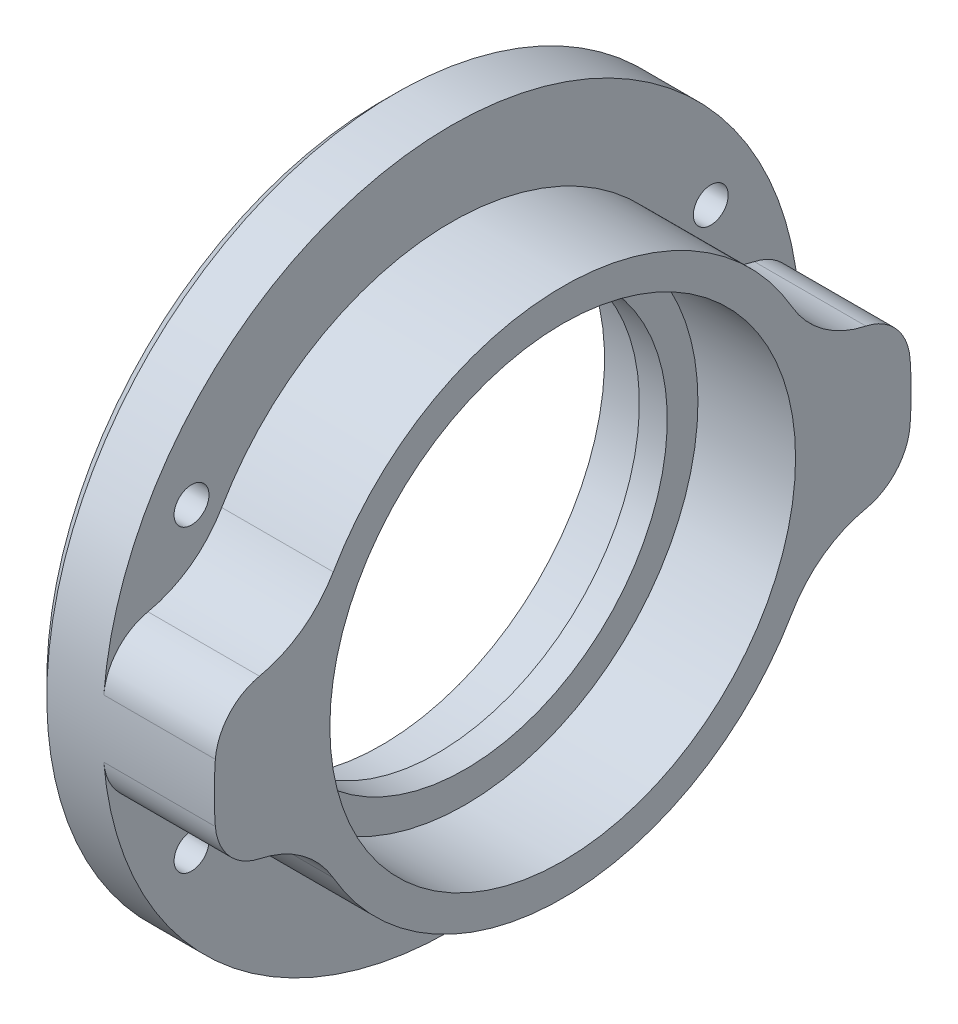
ISO-10303-21;
HEADER;
FILE_DESCRIPTION(('STEP AP214'),'2;1');
FILE_NAME('part.step','',(''),(''),'','','');
FILE_SCHEMA(('AUTOMOTIVE_DESIGN { 1 0 10303 214 1 1 1 1 }'));
ENDSEC;
DATA;
#1=APPLICATION_CONTEXT('core data for automotive mechanical design processes');
#2=APPLICATION_PROTOCOL_DEFINITION('international standard','automotive_design',2000,#1);
#3=PRODUCT_CONTEXT('',#1,'mechanical');
#4=PRODUCT('Part','Part','',(#3));
#5=PRODUCT_RELATED_PRODUCT_CATEGORY('part','',(#4));
#6=PRODUCT_DEFINITION_FORMATION('','',#4);
#7=PRODUCT_DEFINITION_CONTEXT('part definition',#1,'design');
#8=PRODUCT_DEFINITION('design','',#6,#7);
#9=PRODUCT_DEFINITION_SHAPE('','',#8);
#10=(LENGTH_UNIT() NAMED_UNIT(*) SI_UNIT(.MILLI.,.METRE.));
#11=(NAMED_UNIT(*) PLANE_ANGLE_UNIT() SI_UNIT($,.RADIAN.));
#12=(NAMED_UNIT(*) SI_UNIT($,.STERADIAN.) SOLID_ANGLE_UNIT());
#13=UNCERTAINTY_MEASURE_WITH_UNIT(LENGTH_MEASURE(1.E-05),#10,'distance_accuracy_value','');
#14=(GEOMETRIC_REPRESENTATION_CONTEXT(3) GLOBAL_UNCERTAINTY_ASSIGNED_CONTEXT((#13)) GLOBAL_UNIT_ASSIGNED_CONTEXT((#10,
#11,#12)) REPRESENTATION_CONTEXT('',''));
#15=CARTESIAN_POINT('',(0.,0.,0.));
#16=DIRECTION('',(0.,0.,1.));
#17=DIRECTION('',(1.,0.,0.));
#18=AXIS2_PLACEMENT_3D('',#15,#16,#17);
#19=CARTESIAN_POINT('',(-18.5380469099545,0.,0.));
#20=DIRECTION('',(-1.,0.,0.));
#21=DIRECTION('',(0.,0.,1.));
#22=AXIS2_PLACEMENT_3D('',#19,#20,#21);
#23=CYLINDRICAL_SURFACE('',#22,19.);
#24=DIRECTION('',(-1.,0.,0.));
#25=VECTOR('',#24,1.);
#26=CARTESIAN_POINT('',(3.,-9.50000000000003,-16.4544826719043));
#27=LINE('',#26,#25);
#28=CARTESIAN_POINT('',(3.,-9.50000000000003,-16.4544826719043));
#29=VERTEX_POINT('',#28);
#30=CARTESIAN_POINT('',(-5.,-9.50000000000003,-16.4544826719043));
#31=VERTEX_POINT('',#30);
#32=EDGE_CURVE('E157',#29,#31,#27,.T.);
#33=ORIENTED_EDGE('',*,*,#32,.F.);
#34=CARTESIAN_POINT('',(3.,0.,0.));
#35=DIRECTION('',(-1.,0.,0.));
#36=DIRECTION('',(0.,0.,1.));
#37=AXIS2_PLACEMENT_3D('',#34,#35,#36);
#38=CIRCLE('',#37,19.);
#39=CARTESIAN_POINT('',(3.,-9.50000000000002,16.4544826719043));
#40=VERTEX_POINT('',#39);
#41=EDGE_CURVE('E138',#29,#40,#38,.T.);
#42=ORIENTED_EDGE('',*,*,#41,.T.);
#43=DIRECTION('',(-1.,0.,0.));
#44=VECTOR('',#43,1.);
#45=CARTESIAN_POINT('',(3.,-9.50000000000002,16.4544826719043));
#46=LINE('',#45,#44);
#47=CARTESIAN_POINT('',(-5.,-9.50000000000002,16.4544826719043));
#48=VERTEX_POINT('',#47);
#49=EDGE_CURVE('E223',#40,#48,#46,.T.);
#50=ORIENTED_EDGE('',*,*,#49,.T.);
#51=CARTESIAN_POINT('',(-5.,0.,0.));
#52=DIRECTION('',(-1.,0.,0.));
#53=DIRECTION('',(0.,0.,1.));
#54=AXIS2_PLACEMENT_3D('',#51,#52,#53);
#55=CIRCLE('',#54,19.);
#56=EDGE_CURVE('E158',#31,#48,#55,.T.);
#57=ORIENTED_EDGE('',*,*,#56,.F.);
#58=EDGE_LOOP('',(#33,#42,#50,#57));
#59=FACE_BOUND('',#58,.T.);
#60=ADVANCED_FACE('F47',(#59),#23,.T.);
#61=CARTESIAN_POINT('',(-5.,19.,0.));
#62=DIRECTION('',(-1.,0.,0.));
#63=DIRECTION('',(0.,0.,1.));
#64=AXIS2_PLACEMENT_3D('',#61,#62,#63);
#65=PLANE('',#64);
#66=CARTESIAN_POINT('',(-5.,-10.75,18.6195461813654));
#67=DIRECTION('',(-1.,0.,0.));
#68=DIRECTION('',(0.,0.,1.));
#69=AXIS2_PLACEMENT_3D('',#66,#67,#68);
#70=CIRCLE('',#69,1.25);
#71=CARTESIAN_POINT('',(-5.,-10.75,19.8695461813654));
#72=VERTEX_POINT('',#71);
#73=EDGE_CURVE('E342',#72,#72,#70,.T.);
#74=ORIENTED_EDGE('',*,*,#73,.T.);
#75=EDGE_LOOP('',(#74));
#76=FACE_BOUND('',#75,.T.);
#77=CARTESIAN_POINT('',(-5.,-10.75,-18.6195461813654));
#78=DIRECTION('',(-1.,0.,0.));
#79=DIRECTION('',(0.,0.,1.));
#80=AXIS2_PLACEMENT_3D('',#77,#78,#79);
#81=CIRCLE('',#80,1.25);
#82=CARTESIAN_POINT('',(-5.,-10.75,-17.3695461813654));
#83=VERTEX_POINT('',#82);
#84=EDGE_CURVE('E336',#83,#83,#81,.T.);
#85=ORIENTED_EDGE('',*,*,#84,.T.);
#86=EDGE_LOOP('',(#85));
#87=FACE_BOUND('',#86,.T.);
#88=CARTESIAN_POINT('',(-5.,-1.7540333075852,-20.9266186269039));
#89=DIRECTION('',(-1.,0.,0.));
#90=DIRECTION('',(0.,0.,1.));
#91=AXIS2_PLACEMENT_3D('',#88,#89,#90);
#92=CIRCLE('',#91,4.);
#93=CARTESIAN_POINT('',(-5.,-2.08813488998238,-24.9126412225047));
#94=VERTEX_POINT('',#93);
#95=CARTESIAN_POINT('',(-5.,-5.66935553839015,-21.7453077186626));
#96=VERTEX_POINT('',#95);
#97=EDGE_CURVE('E63',#94,#96,#92,.T.);
#98=ORIENTED_EDGE('',*,*,#97,.T.);
#99=CARTESIAN_POINT('',(-5.,-13.5,-23.3826859021798));
#100=DIRECTION('',(-1.,0.,0.));
#101=DIRECTION('',(0.,0.,1.));
#102=AXIS2_PLACEMENT_3D('',#99,#100,#101);
#103=CIRCLE('',#102,8.);
#104=EDGE_CURVE('E182',#96,#31,#103,.F.);
#105=ORIENTED_EDGE('',*,*,#104,.T.);
#106=ORIENTED_EDGE('',*,*,#56,.T.);
#107=CARTESIAN_POINT('',(-5.,-13.5,23.3826859021798));
#108=DIRECTION('',(-1.,0.,0.));
#109=DIRECTION('',(0.,0.,1.));
#110=AXIS2_PLACEMENT_3D('',#107,#108,#109);
#111=CIRCLE('',#110,8.);
#112=CARTESIAN_POINT('',(-5.,-5.66935553839014,21.7453077186626));
#113=VERTEX_POINT('',#112);
#114=EDGE_CURVE('E193',#48,#113,#111,.F.);
#115=ORIENTED_EDGE('',*,*,#114,.T.);
#116=CARTESIAN_POINT('',(-5.,-1.7540333075852,20.9266186269039));
#117=DIRECTION('',(-1.,0.,0.));
#118=DIRECTION('',(0.,0.,1.));
#119=AXIS2_PLACEMENT_3D('',#116,#117,#118);
#120=CIRCLE('',#119,4.);
#121=CARTESIAN_POINT('',(-5.,-2.08813488998238,24.9126412225047));
#122=VERTEX_POINT('',#121);
#123=EDGE_CURVE('E189',#113,#122,#120,.T.);
#124=ORIENTED_EDGE('',*,*,#123,.T.);
#125=CARTESIAN_POINT('',(-5.,0.,0.));
#126=DIRECTION('',(-1.,0.,0.));
#127=DIRECTION('',(0.,0.,1.));
#128=AXIS2_PLACEMENT_3D('',#125,#126,#127);
#129=CIRCLE('',#128,25.);
#130=EDGE_CURVE('E231',#94,#122,#129,.T.);
#131=ORIENTED_EDGE('',*,*,#130,.F.);
#132=EDGE_LOOP('',(#98,#105,#106,#115,#124,#131));
#133=FACE_BOUND('',#132,.T.);
#134=ADVANCED_FACE('F277',(#76,#87,#133),#65,.F.);
#135=CARTESIAN_POINT('',(3.,9.50000000000002,16.4544826719043));
#136=VERTEX_POINT('',#135);
#137=CARTESIAN_POINT('',(3.,9.50000000000003,-16.4544826719043));
#138=VERTEX_POINT('',#137);
#139=EDGE_CURVE('E152',#136,#138,#38,.T.);
#140=ORIENTED_EDGE('',*,*,#139,.T.);
#141=DIRECTION('',(-1.,0.,0.));
#142=VECTOR('',#141,1.);
#143=CARTESIAN_POINT('',(3.,9.50000000000003,-16.4544826719043));
#144=LINE('',#143,#142);
#145=CARTESIAN_POINT('',(-5.,9.50000000000003,-16.4544826719043));
#146=VERTEX_POINT('',#145);
#147=EDGE_CURVE('E162',#138,#146,#144,.T.);
#148=ORIENTED_EDGE('',*,*,#147,.T.);
#149=CARTESIAN_POINT('',(-5.,9.50000000000002,16.4544826719043));
#150=VERTEX_POINT('',#149);
#151=EDGE_CURVE('E229',#150,#146,#55,.T.);
#152=ORIENTED_EDGE('',*,*,#151,.F.);
#153=DIRECTION('',(-1.,0.,0.));
#154=VECTOR('',#153,1.);
#155=CARTESIAN_POINT('',(3.,9.50000000000002,16.4544826719043));
#156=LINE('',#155,#154);
#157=EDGE_CURVE('E210',#136,#150,#156,.T.);
#158=ORIENTED_EDGE('',*,*,#157,.F.);
#159=EDGE_LOOP('',(#140,#148,#152,#158));
#160=FACE_BOUND('',#159,.T.);
#161=ADVANCED_FACE('F279',(#160),#23,.T.);
#162=CARTESIAN_POINT('',(-18.5380469099545,0.,0.));
#163=DIRECTION('',(-1.,0.,0.));
#164=DIRECTION('',(0.,0.,1.));
#165=AXIS2_PLACEMENT_3D('',#162,#163,#164);
#166=CYLINDRICAL_SURFACE('',#165,16.7);
#167=CARTESIAN_POINT('',(3.,0.,0.));
#168=DIRECTION('',(-1.,0.,0.));
#169=DIRECTION('',(0.,0.,1.));
#170=AXIS2_PLACEMENT_3D('',#167,#168,#169);
#171=CIRCLE('',#170,16.7);
#172=CARTESIAN_POINT('',(3.,0.,16.7));
#173=VERTEX_POINT('',#172);
#174=EDGE_CURVE('E153',#173,#173,#171,.T.);
#175=ORIENTED_EDGE('',*,*,#174,.F.);
#176=EDGE_LOOP('',(#175));
#177=FACE_BOUND('',#176,.T.);
#178=CARTESIAN_POINT('',(-4.,0.,0.));
#179=DIRECTION('',(-1.,0.,0.));
#180=DIRECTION('',(0.,0.,1.));
#181=AXIS2_PLACEMENT_3D('',#178,#179,#180);
#182=CIRCLE('',#181,16.7);
#183=CARTESIAN_POINT('',(-4.,0.,16.7));
#184=VERTEX_POINT('',#183);
#185=EDGE_CURVE('E247',#184,#184,#182,.T.);
#186=ORIENTED_EDGE('',*,*,#185,.T.);
#187=EDGE_LOOP('',(#186));
#188=FACE_BOUND('',#187,.T.);
#189=ADVANCED_FACE('F289',(#177,#188),#166,.F.);
#190=CARTESIAN_POINT('',(-4.,16.7,0.));
#191=DIRECTION('',(-1.,0.,0.));
#192=DIRECTION('',(0.,0.,1.));
#193=AXIS2_PLACEMENT_3D('',#190,#191,#192);
#194=PLANE('',#193);
#195=ORIENTED_EDGE('',*,*,#185,.F.);
#196=EDGE_LOOP('',(#195));
#197=FACE_BOUND('',#196,.T.);
#198=CARTESIAN_POINT('',(-4.,0.,0.));
#199=DIRECTION('',(-1.,0.,0.));
#200=DIRECTION('',(0.,0.,1.));
#201=AXIS2_PLACEMENT_3D('',#198,#199,#200);
#202=CIRCLE('',#201,14.5);
#203=CARTESIAN_POINT('',(-4.,0.,14.5));
#204=VERTEX_POINT('',#203);
#205=EDGE_CURVE('E244',#204,#204,#202,.T.);
#206=ORIENTED_EDGE('',*,*,#205,.T.);
#207=EDGE_LOOP('',(#206));
#208=FACE_BOUND('',#207,.T.);
#209=ADVANCED_FACE('F295',(#197,#208),#194,.F.);
#210=CARTESIAN_POINT('',(-18.5380469099545,0.,0.));
#211=DIRECTION('',(-1.,0.,0.));
#212=DIRECTION('',(0.,0.,1.));
#213=AXIS2_PLACEMENT_3D('',#210,#211,#212);
#214=CYLINDRICAL_SURFACE('',#213,14.5);
#215=ORIENTED_EDGE('',*,*,#205,.F.);
#216=EDGE_LOOP('',(#215));
#217=FACE_BOUND('',#216,.T.);
#218=CARTESIAN_POINT('',(-6.,0.,0.));
#219=DIRECTION('',(-1.,0.,0.));
#220=DIRECTION('',(0.,0.,1.));
#221=AXIS2_PLACEMENT_3D('',#218,#219,#220);
#222=CIRCLE('',#221,14.5);
#223=CARTESIAN_POINT('',(-6.,0.,14.5));
#224=VERTEX_POINT('',#223);
#225=EDGE_CURVE('E241',#224,#224,#222,.T.);
#226=ORIENTED_EDGE('',*,*,#225,.T.);
#227=EDGE_LOOP('',(#226));
#228=FACE_BOUND('',#227,.T.);
#229=ADVANCED_FACE('F370',(#217,#228),#214,.F.);
#230=CARTESIAN_POINT('',(-6.,16.,0.));
#231=DIRECTION('',(1.,0.,0.));
#232=DIRECTION('',(0.,0.,-1.));
#233=AXIS2_PLACEMENT_3D('',#230,#231,#232);
#234=PLANE('',#233);
#235=ORIENTED_EDGE('',*,*,#225,.F.);
#236=EDGE_LOOP('',(#235));
#237=FACE_BOUND('',#236,.T.);
#238=CARTESIAN_POINT('',(-6.,0.,0.));
#239=DIRECTION('',(-1.,0.,0.));
#240=DIRECTION('',(0.,0.,1.));
#241=AXIS2_PLACEMENT_3D('',#238,#239,#240);
#242=CIRCLE('',#241,16.);
#243=CARTESIAN_POINT('',(-6.,0.,16.));
#244=VERTEX_POINT('',#243);
#245=EDGE_CURVE('E238',#244,#244,#242,.T.);
#246=ORIENTED_EDGE('',*,*,#245,.T.);
#247=EDGE_LOOP('',(#246));
#248=FACE_BOUND('',#247,.T.);
#249=ADVANCED_FACE('F363',(#237,#248),#234,.F.);
#250=CARTESIAN_POINT('',(-18.5380469099545,0.,0.));
#251=DIRECTION('',(-1.,0.,0.));
#252=DIRECTION('',(0.,0.,1.));
#253=AXIS2_PLACEMENT_3D('',#250,#251,#252);
#254=CYLINDRICAL_SURFACE('',#253,16.);
#255=ORIENTED_EDGE('',*,*,#245,.F.);
#256=EDGE_LOOP('',(#255));
#257=FACE_BOUND('',#256,.T.);
#258=CARTESIAN_POINT('',(-10.,0.,0.));
#259=DIRECTION('',(-1.,0.,0.));
#260=DIRECTION('',(0.,0.,1.));
#261=AXIS2_PLACEMENT_3D('',#258,#259,#260);
#262=CIRCLE('',#261,16.);
#263=CARTESIAN_POINT('',(-10.,0.,16.));
#264=VERTEX_POINT('',#263);
#265=EDGE_CURVE('E235',#264,#264,#262,.T.);
#266=ORIENTED_EDGE('',*,*,#265,.T.);
#267=EDGE_LOOP('',(#266));
#268=FACE_BOUND('',#267,.T.);
#269=ADVANCED_FACE('F352',(#257,#268),#254,.F.);
#270=CARTESIAN_POINT('',(-10.,16.,0.));
#271=DIRECTION('',(1.,0.,0.));
#272=DIRECTION('',(0.,0.,-1.));
#273=AXIS2_PLACEMENT_3D('',#270,#271,#272);
#274=PLANE('',#273);
#275=CARTESIAN_POINT('',(-10.,0.,0.));
#276=DIRECTION('',(1.,0.,0.));
#277=DIRECTION('',(0.,0.,-1.));
#278=AXIS2_PLACEMENT_3D('',#275,#276,#277);
#279=CIRCLE('',#278,24.);
#280=CARTESIAN_POINT('',(-10.,0.,-24.));
#281=VERTEX_POINT('',#280);
#282=EDGE_CURVE('E56',#281,#281,#279,.F.);
#283=ORIENTED_EDGE('',*,*,#282,.T.);
#284=EDGE_LOOP('',(#283));
#285=FACE_BOUND('',#284,.T.);
#286=CARTESIAN_POINT('',(-10.,10.75,18.6195461813654));
#287=DIRECTION('',(-1.,0.,0.));
#288=DIRECTION('',(0.,0.,1.));
#289=AXIS2_PLACEMENT_3D('',#286,#287,#288);
#290=CIRCLE('',#289,1.25);
#291=CARTESIAN_POINT('',(-10.,10.75,19.8695461813654));
#292=VERTEX_POINT('',#291);
#293=EDGE_CURVE('E257',#292,#292,#290,.T.);
#294=ORIENTED_EDGE('',*,*,#293,.F.);
#295=EDGE_LOOP('',(#294));
#296=FACE_BOUND('',#295,.T.);
#297=CARTESIAN_POINT('',(-10.,-10.75,18.6195461813654));
#298=DIRECTION('',(-1.,0.,0.));
#299=DIRECTION('',(0.,0.,1.));
#300=AXIS2_PLACEMENT_3D('',#297,#298,#299);
#301=CIRCLE('',#300,1.25);
#302=CARTESIAN_POINT('',(-10.,-10.75,19.8695461813654));
#303=VERTEX_POINT('',#302);
#304=EDGE_CURVE('E256',#303,#303,#301,.T.);
#305=ORIENTED_EDGE('',*,*,#304,.F.);
#306=EDGE_LOOP('',(#305));
#307=FACE_BOUND('',#306,.T.);
#308=CARTESIAN_POINT('',(-10.,-10.75,-18.6195461813654));
#309=DIRECTION('',(-1.,0.,0.));
#310=DIRECTION('',(0.,0.,1.));
#311=AXIS2_PLACEMENT_3D('',#308,#309,#310);
#312=CIRCLE('',#311,1.25);
#313=CARTESIAN_POINT('',(-10.,-10.75,-17.3695461813654));
#314=VERTEX_POINT('',#313);
#315=EDGE_CURVE('E339',#314,#314,#312,.T.);
#316=ORIENTED_EDGE('',*,*,#315,.F.);
#317=EDGE_LOOP('',(#316));
#318=FACE_BOUND('',#317,.T.);
#319=CARTESIAN_POINT('',(-10.,10.75,-18.6195461813654));
#320=DIRECTION('',(-1.,0.,0.));
#321=DIRECTION('',(0.,0.,1.));
#322=AXIS2_PLACEMENT_3D('',#319,#320,#321);
#323=CIRCLE('',#322,1.25);
#324=CARTESIAN_POINT('',(-10.,10.75,-17.3695461813654));
#325=VERTEX_POINT('',#324);
#326=EDGE_CURVE('E253',#325,#325,#323,.T.);
#327=ORIENTED_EDGE('',*,*,#326,.F.);
#328=EDGE_LOOP('',(#327));
#329=FACE_BOUND('',#328,.T.);
#330=ORIENTED_EDGE('',*,*,#265,.F.);
#331=EDGE_LOOP('',(#330));
#332=FACE_BOUND('',#331,.T.);
#333=ADVANCED_FACE('F261',(#285,#296,#307,#318,#329,#332),#274,.F.);
#334=CARTESIAN_POINT('',(-18.5380469099545,0.,0.));
#335=DIRECTION('',(-1.,0.,0.));
#336=DIRECTION('',(0.,0.,1.));
#337=AXIS2_PLACEMENT_3D('',#334,#335,#336);
#338=CYLINDRICAL_SURFACE('',#337,25.);
#339=CARTESIAN_POINT('',(-9.,0.,0.));
#340=DIRECTION('',(1.,0.,0.));
#341=DIRECTION('',(0.,0.,-1.));
#342=AXIS2_PLACEMENT_3D('',#339,#340,#341);
#343=CIRCLE('',#342,25.);
#344=CARTESIAN_POINT('',(-9.,0.,-25.));
#345=VERTEX_POINT('',#344);
#346=EDGE_CURVE('E11',#345,#345,#343,.T.);
#347=ORIENTED_EDGE('',*,*,#346,.T.);
#348=EDGE_LOOP('',(#347));
#349=FACE_BOUND('',#348,.T.);
#350=CARTESIAN_POINT('',(-5.,2.08813488998239,24.9126412225047));
#351=VERTEX_POINT('',#350);
#352=CARTESIAN_POINT('',(-5.,2.08813488998238,-24.9126412225047));
#353=VERTEX_POINT('',#352);
#354=EDGE_CURVE('E232',#351,#353,#129,.T.);
#355=ORIENTED_EDGE('',*,*,#354,.T.);
#356=DIRECTION('',(-1.,0.,0.));
#357=VECTOR('',#356,1.);
#358=CARTESIAN_POINT('',(3.,2.08813488998238,-24.9126412225047));
#359=LINE('',#358,#357);
#360=CARTESIAN_POINT('',(3.,2.08813488998238,-24.9126412225047));
#361=VERTEX_POINT('',#360);
#362=EDGE_CURVE('E170',#361,#353,#359,.T.);
#363=ORIENTED_EDGE('',*,*,#362,.F.);
#364=CARTESIAN_POINT('',(3.,0.,0.));
#365=DIRECTION('',(-1.,0.,0.));
#366=DIRECTION('',(0.,0.,1.));
#367=AXIS2_PLACEMENT_3D('',#364,#365,#366);
#368=CIRCLE('',#367,25.);
#369=CARTESIAN_POINT('',(3.,-2.08813488998238,-24.9126412225047));
#370=VERTEX_POINT('',#369);
#371=EDGE_CURVE('E168',#361,#370,#368,.T.);
#372=ORIENTED_EDGE('',*,*,#371,.T.);
#373=DIRECTION('',(-1.,0.,0.));
#374=VECTOR('',#373,1.);
#375=CARTESIAN_POINT('',(3.,-2.08813488998238,-24.9126412225047));
#376=LINE('',#375,#374);
#377=EDGE_CURVE('E327',#370,#94,#376,.T.);
#378=ORIENTED_EDGE('',*,*,#377,.T.);
#379=ORIENTED_EDGE('',*,*,#130,.T.);
#380=DIRECTION('',(-1.,0.,0.));
#381=VECTOR('',#380,1.);
#382=CARTESIAN_POINT('',(3.,-2.08813488998238,24.9126412225047));
#383=LINE('',#382,#381);
#384=CARTESIAN_POINT('',(3.,-2.08813488998238,24.9126412225047));
#385=VERTEX_POINT('',#384);
#386=EDGE_CURVE('E217',#385,#122,#383,.T.);
#387=ORIENTED_EDGE('',*,*,#386,.F.);
#388=CARTESIAN_POINT('',(3.,0.,0.));
#389=DIRECTION('',(-1.,0.,0.));
#390=DIRECTION('',(0.,0.,-1.));
#391=AXIS2_PLACEMENT_3D('',#388,#389,#390);
#392=CIRCLE('',#391,25.);
#393=CARTESIAN_POINT('',(3.,2.08813488998239,24.9126412225047));
#394=VERTEX_POINT('',#393);
#395=EDGE_CURVE('E204',#385,#394,#392,.T.);
#396=ORIENTED_EDGE('',*,*,#395,.T.);
#397=DIRECTION('',(-1.,0.,0.));
#398=VECTOR('',#397,1.);
#399=CARTESIAN_POINT('',(3.,2.08813488998239,24.9126412225047));
#400=LINE('',#399,#398);
#401=EDGE_CURVE('E214',#394,#351,#400,.T.);
#402=ORIENTED_EDGE('',*,*,#401,.T.);
#403=EDGE_LOOP('',(#355,#363,#372,#378,#379,#387,#396,#402));
#404=FACE_BOUND('',#403,.T.);
#405=ADVANCED_FACE('F311',(#349,#404),#338,.T.);
#406=CARTESIAN_POINT('',(-5.,10.75,18.6195461813654));
#407=DIRECTION('',(-1.,0.,0.));
#408=DIRECTION('',(0.,0.,1.));
#409=AXIS2_PLACEMENT_3D('',#406,#407,#408);
#410=CIRCLE('',#409,1.25);
#411=CARTESIAN_POINT('',(-5.,10.75,19.8695461813654));
#412=VERTEX_POINT('',#411);
#413=EDGE_CURVE('E254',#412,#412,#410,.T.);
#414=ORIENTED_EDGE('',*,*,#413,.T.);
#415=EDGE_LOOP('',(#414));
#416=FACE_BOUND('',#415,.T.);
#417=CARTESIAN_POINT('',(-5.,10.75,-18.6195461813654));
#418=DIRECTION('',(-1.,0.,0.));
#419=DIRECTION('',(0.,0.,1.));
#420=AXIS2_PLACEMENT_3D('',#417,#418,#419);
#421=CIRCLE('',#420,1.25);
#422=CARTESIAN_POINT('',(-5.,10.75,-17.3695461813654));
#423=VERTEX_POINT('',#422);
#424=EDGE_CURVE('E250',#423,#423,#421,.T.);
#425=ORIENTED_EDGE('',*,*,#424,.T.);
#426=EDGE_LOOP('',(#425));
#427=FACE_BOUND('',#426,.T.);
#428=ORIENTED_EDGE('',*,*,#151,.T.);
#429=CARTESIAN_POINT('',(-5.,13.5,-23.3826859021798));
#430=DIRECTION('',(-1.,0.,0.));
#431=DIRECTION('',(0.,0.,1.));
#432=AXIS2_PLACEMENT_3D('',#429,#430,#431);
#433=CIRCLE('',#432,8.);
#434=CARTESIAN_POINT('',(-5.,5.66935553839015,-21.7453077186626));
#435=VERTEX_POINT('',#434);
#436=EDGE_CURVE('E71',#146,#435,#433,.F.);
#437=ORIENTED_EDGE('',*,*,#436,.T.);
#438=CARTESIAN_POINT('',(-5.,1.7540333075852,-20.9266186269039));
#439=DIRECTION('',(-1.,0.,0.));
#440=DIRECTION('',(0.,0.,1.));
#441=AXIS2_PLACEMENT_3D('',#438,#439,#440);
#442=CIRCLE('',#441,4.);
#443=EDGE_CURVE('E185',#435,#353,#442,.T.);
#444=ORIENTED_EDGE('',*,*,#443,.T.);
#445=ORIENTED_EDGE('',*,*,#354,.F.);
#446=CARTESIAN_POINT('',(-5.,1.7540333075852,20.9266186269039));
#447=DIRECTION('',(-1.,0.,0.));
#448=DIRECTION('',(0.,0.,1.));
#449=AXIS2_PLACEMENT_3D('',#446,#447,#448);
#450=CIRCLE('',#449,4.);
#451=CARTESIAN_POINT('',(-5.,5.66935553839015,21.7453077186626));
#452=VERTEX_POINT('',#451);
#453=EDGE_CURVE('E184',#351,#452,#450,.T.);
#454=ORIENTED_EDGE('',*,*,#453,.T.);
#455=CARTESIAN_POINT('',(-5.,13.5,23.3826859021798));
#456=DIRECTION('',(-1.,0.,0.));
#457=DIRECTION('',(0.,0.,1.));
#458=AXIS2_PLACEMENT_3D('',#455,#456,#457);
#459=CIRCLE('',#458,8.);
#460=EDGE_CURVE('E195',#452,#150,#459,.F.);
#461=ORIENTED_EDGE('',*,*,#460,.T.);
#462=EDGE_LOOP('',(#428,#437,#444,#445,#454,#461));
#463=FACE_BOUND('',#462,.T.);
#464=ADVANCED_FACE('F286',(#416,#427,#463),#65,.F.);
#465=CARTESIAN_POINT('',(3.,19.,0.));
#466=DIRECTION('',(-1.,0.,0.));
#467=DIRECTION('',(0.,0.,1.));
#468=AXIS2_PLACEMENT_3D('',#465,#466,#467);
#469=PLANE('',#468);
#470=ORIENTED_EDGE('',*,*,#139,.F.);
#471=CARTESIAN_POINT('',(3.,13.5,23.3826859021798));
#472=DIRECTION('',(1.,0.,0.));
#473=DIRECTION('',(0.,0.,1.));
#474=AXIS2_PLACEMENT_3D('',#471,#472,#473);
#475=CIRCLE('',#474,8.);
#476=CARTESIAN_POINT('',(3.,5.66935553839015,21.7453077186626));
#477=VERTEX_POINT('',#476);
#478=EDGE_CURVE('E192',#477,#136,#475,.T.);
#479=ORIENTED_EDGE('',*,*,#478,.F.);
#480=CARTESIAN_POINT('',(3.,1.7540333075852,20.9266186269039));
#481=DIRECTION('',(-1.,0.,0.));
#482=DIRECTION('',(0.,0.,-1.));
#483=AXIS2_PLACEMENT_3D('',#480,#481,#482);
#484=CIRCLE('',#483,4.);
#485=EDGE_CURVE('E207',#394,#477,#484,.T.);
#486=ORIENTED_EDGE('',*,*,#485,.F.);
#487=ORIENTED_EDGE('',*,*,#395,.F.);
#488=CARTESIAN_POINT('',(3.,-1.7540333075852,20.9266186269039));
#489=DIRECTION('',(-1.,0.,0.));
#490=DIRECTION('',(0.,0.,1.));
#491=AXIS2_PLACEMENT_3D('',#488,#489,#490);
#492=CIRCLE('',#491,4.);
#493=CARTESIAN_POINT('',(3.,-5.66935553839014,21.7453077186626));
#494=VERTEX_POINT('',#493);
#495=EDGE_CURVE('E201',#494,#385,#492,.T.);
#496=ORIENTED_EDGE('',*,*,#495,.F.);
#497=CARTESIAN_POINT('',(3.,-13.5,23.3826859021798));
#498=DIRECTION('',(1.,0.,0.));
#499=DIRECTION('',(0.,0.,-1.));
#500=AXIS2_PLACEMENT_3D('',#497,#498,#499);
#501=CIRCLE('',#500,8.);
#502=EDGE_CURVE('E148',#40,#494,#501,.T.);
#503=ORIENTED_EDGE('',*,*,#502,.F.);
#504=ORIENTED_EDGE('',*,*,#41,.F.);
#505=CARTESIAN_POINT('',(3.,-13.5,-23.3826859021798));
#506=DIRECTION('',(1.,0.,0.));
#507=DIRECTION('',(0.,0.,1.));
#508=AXIS2_PLACEMENT_3D('',#505,#506,#507);
#509=CIRCLE('',#508,8.);
#510=CARTESIAN_POINT('',(3.,-5.66935553839015,-21.7453077186626));
#511=VERTEX_POINT('',#510);
#512=EDGE_CURVE('E144',#511,#29,#509,.T.);
#513=ORIENTED_EDGE('',*,*,#512,.F.);
#514=CARTESIAN_POINT('',(3.,-1.7540333075852,-20.9266186269039));
#515=DIRECTION('',(-1.,0.,0.));
#516=DIRECTION('',(0.,0.,-1.));
#517=AXIS2_PLACEMENT_3D('',#514,#515,#516);
#518=CIRCLE('',#517,4.);
#519=EDGE_CURVE('E165',#370,#511,#518,.T.);
#520=ORIENTED_EDGE('',*,*,#519,.F.);
#521=ORIENTED_EDGE('',*,*,#371,.F.);
#522=CARTESIAN_POINT('',(3.,1.7540333075852,-20.9266186269039));
#523=DIRECTION('',(-1.,0.,0.));
#524=DIRECTION('',(0.,0.,1.));
#525=AXIS2_PLACEMENT_3D('',#522,#523,#524);
#526=CIRCLE('',#525,4.);
#527=CARTESIAN_POINT('',(3.,5.66935553839015,-21.7453077186626));
#528=VERTEX_POINT('',#527);
#529=EDGE_CURVE('E176',#528,#361,#526,.T.);
#530=ORIENTED_EDGE('',*,*,#529,.F.);
#531=CARTESIAN_POINT('',(3.,13.5,-23.3826859021798));
#532=DIRECTION('',(1.,0.,0.));
#533=DIRECTION('',(0.,0.,-1.));
#534=AXIS2_PLACEMENT_3D('',#531,#532,#533);
#535=CIRCLE('',#534,8.);
#536=EDGE_CURVE('E179',#138,#528,#535,.T.);
#537=ORIENTED_EDGE('',*,*,#536,.F.);
#538=EDGE_LOOP('',(#470,#479,#486,#487,#496,#503,#504,#513,#520,#521,#530,#537));
#539=FACE_BOUND('',#538,.T.);
#540=ORIENTED_EDGE('',*,*,#174,.T.);
#541=EDGE_LOOP('',(#540));
#542=FACE_BOUND('',#541,.T.);
#543=ADVANCED_FACE('F140',(#539,#542),#469,.F.);
#544=CARTESIAN_POINT('',(3.,13.5,23.3826859021798));
#545=DIRECTION('',(-1.,0.,0.));
#546=DIRECTION('',(0.,0.,1.));
#547=AXIS2_PLACEMENT_3D('',#544,#545,#546);
#548=CYLINDRICAL_SURFACE('',#547,8.);
#549=ORIENTED_EDGE('',*,*,#157,.T.);
#550=ORIENTED_EDGE('',*,*,#460,.F.);
#551=DIRECTION('',(-1.,0.,0.));
#552=VECTOR('',#551,1.);
#553=CARTESIAN_POINT('',(3.,5.66935553839015,21.7453077186626));
#554=LINE('',#553,#552);
#555=EDGE_CURVE('E211',#477,#452,#554,.T.);
#556=ORIENTED_EDGE('',*,*,#555,.F.);
#557=ORIENTED_EDGE('',*,*,#478,.T.);
#558=EDGE_LOOP('',(#549,#550,#556,#557));
#559=FACE_BOUND('',#558,.T.);
#560=ADVANCED_FACE('F319',(#559),#548,.F.);
#561=CARTESIAN_POINT('',(3.,1.7540333075852,20.9266186269039));
#562=DIRECTION('',(-1.,0.,0.));
#563=DIRECTION('',(0.,0.,1.));
#564=AXIS2_PLACEMENT_3D('',#561,#562,#563);
#565=CYLINDRICAL_SURFACE('',#564,4.);
#566=ORIENTED_EDGE('',*,*,#555,.T.);
#567=ORIENTED_EDGE('',*,*,#453,.F.);
#568=ORIENTED_EDGE('',*,*,#401,.F.);
#569=ORIENTED_EDGE('',*,*,#485,.T.);
#570=EDGE_LOOP('',(#566,#567,#568,#569));
#571=FACE_BOUND('',#570,.T.);
#572=ADVANCED_FACE('F316',(#571),#565,.T.);
#573=CARTESIAN_POINT('',(3.,-1.7540333075852,20.9266186269039));
#574=DIRECTION('',(-1.,0.,0.));
#575=DIRECTION('',(0.,0.,1.));
#576=AXIS2_PLACEMENT_3D('',#573,#574,#575);
#577=CYLINDRICAL_SURFACE('',#576,4.);
#578=ORIENTED_EDGE('',*,*,#386,.T.);
#579=ORIENTED_EDGE('',*,*,#123,.F.);
#580=DIRECTION('',(-1.,0.,0.));
#581=VECTOR('',#580,1.);
#582=CARTESIAN_POINT('',(3.,-5.66935553839014,21.7453077186626));
#583=LINE('',#582,#581);
#584=EDGE_CURVE('E220',#494,#113,#583,.T.);
#585=ORIENTED_EDGE('',*,*,#584,.F.);
#586=ORIENTED_EDGE('',*,*,#495,.T.);
#587=EDGE_LOOP('',(#578,#579,#585,#586));
#588=FACE_BOUND('',#587,.T.);
#589=ADVANCED_FACE('F321',(#588),#577,.T.);
#590=CARTESIAN_POINT('',(3.,-13.5,23.3826859021798));
#591=DIRECTION('',(-1.,0.,0.));
#592=DIRECTION('',(0.,0.,1.));
#593=AXIS2_PLACEMENT_3D('',#590,#591,#592);
#594=CYLINDRICAL_SURFACE('',#593,8.);
#595=ORIENTED_EDGE('',*,*,#584,.T.);
#596=ORIENTED_EDGE('',*,*,#114,.F.);
#597=ORIENTED_EDGE('',*,*,#49,.F.);
#598=ORIENTED_EDGE('',*,*,#502,.T.);
#599=EDGE_LOOP('',(#595,#596,#597,#598));
#600=FACE_BOUND('',#599,.T.);
#601=ADVANCED_FACE('F325',(#600),#594,.F.);
#602=CARTESIAN_POINT('',(3.,13.5,-23.3826859021798));
#603=DIRECTION('',(-1.,0.,0.));
#604=DIRECTION('',(0.,0.,1.));
#605=AXIS2_PLACEMENT_3D('',#602,#603,#604);
#606=CYLINDRICAL_SURFACE('',#605,8.);
#607=DIRECTION('',(-1.,0.,0.));
#608=VECTOR('',#607,1.);
#609=CARTESIAN_POINT('',(3.,5.66935553839015,-21.7453077186626));
#610=LINE('',#609,#608);
#611=EDGE_CURVE('E166',#528,#435,#610,.T.);
#612=ORIENTED_EDGE('',*,*,#611,.T.);
#613=ORIENTED_EDGE('',*,*,#436,.F.);
#614=ORIENTED_EDGE('',*,*,#147,.F.);
#615=ORIENTED_EDGE('',*,*,#536,.T.);
#616=EDGE_LOOP('',(#612,#613,#614,#615));
#617=FACE_BOUND('',#616,.T.);
#618=ADVANCED_FACE('F303',(#617),#606,.F.);
#619=CARTESIAN_POINT('',(3.,-13.5,-23.3826859021798));
#620=DIRECTION('',(-1.,0.,0.));
#621=DIRECTION('',(0.,0.,1.));
#622=AXIS2_PLACEMENT_3D('',#619,#620,#621);
#623=CYLINDRICAL_SURFACE('',#622,8.);
#624=ORIENTED_EDGE('',*,*,#32,.T.);
#625=ORIENTED_EDGE('',*,*,#104,.F.);
#626=DIRECTION('',(-1.,0.,0.));
#627=VECTOR('',#626,1.);
#628=CARTESIAN_POINT('',(3.,-5.66935553839015,-21.7453077186626));
#629=LINE('',#628,#627);
#630=EDGE_CURVE('E161',#511,#96,#629,.T.);
#631=ORIENTED_EDGE('',*,*,#630,.F.);
#632=ORIENTED_EDGE('',*,*,#512,.T.);
#633=EDGE_LOOP('',(#624,#625,#631,#632));
#634=FACE_BOUND('',#633,.T.);
#635=ADVANCED_FACE('F164',(#634),#623,.F.);
#636=CARTESIAN_POINT('',(3.,-1.7540333075852,-20.9266186269039));
#637=DIRECTION('',(-1.,0.,0.));
#638=DIRECTION('',(0.,0.,1.));
#639=AXIS2_PLACEMENT_3D('',#636,#637,#638);
#640=CYLINDRICAL_SURFACE('',#639,4.);
#641=ORIENTED_EDGE('',*,*,#630,.T.);
#642=ORIENTED_EDGE('',*,*,#97,.F.);
#643=ORIENTED_EDGE('',*,*,#377,.F.);
#644=ORIENTED_EDGE('',*,*,#519,.T.);
#645=EDGE_LOOP('',(#641,#642,#643,#644));
#646=FACE_BOUND('',#645,.T.);
#647=ADVANCED_FACE('F330',(#646),#640,.T.);
#648=CARTESIAN_POINT('',(3.,1.7540333075852,-20.9266186269039));
#649=DIRECTION('',(-1.,0.,0.));
#650=DIRECTION('',(0.,0.,1.));
#651=AXIS2_PLACEMENT_3D('',#648,#649,#650);
#652=CYLINDRICAL_SURFACE('',#651,4.);
#653=ORIENTED_EDGE('',*,*,#362,.T.);
#654=ORIENTED_EDGE('',*,*,#443,.F.);
#655=ORIENTED_EDGE('',*,*,#611,.F.);
#656=ORIENTED_EDGE('',*,*,#529,.T.);
#657=EDGE_LOOP('',(#653,#654,#655,#656));
#658=FACE_BOUND('',#657,.T.);
#659=ADVANCED_FACE('F308',(#658),#652,.T.);
#660=CARTESIAN_POINT('',(-10.,10.75,-18.6195461813654));
#661=DIRECTION('',(-1.,0.,0.));
#662=DIRECTION('',(0.,0.,1.));
#663=AXIS2_PLACEMENT_3D('',#660,#661,#662);
#664=CYLINDRICAL_SURFACE('',#663,1.25);
#665=ORIENTED_EDGE('',*,*,#326,.T.);
#666=EDGE_LOOP('',(#665));
#667=FACE_BOUND('',#666,.T.);
#668=ORIENTED_EDGE('',*,*,#424,.F.);
#669=EDGE_LOOP('',(#668));
#670=FACE_BOUND('',#669,.T.);
#671=ADVANCED_FACE('F467',(#667,#670),#664,.F.);
#672=CARTESIAN_POINT('',(-10.,-10.75,-18.6195461813654));
#673=DIRECTION('',(-1.,0.,0.));
#674=DIRECTION('',(0.,0.,1.));
#675=AXIS2_PLACEMENT_3D('',#672,#673,#674);
#676=CYLINDRICAL_SURFACE('',#675,1.25);
#677=ORIENTED_EDGE('',*,*,#315,.T.);
#678=EDGE_LOOP('',(#677));
#679=FACE_BOUND('',#678,.T.);
#680=ORIENTED_EDGE('',*,*,#84,.F.);
#681=EDGE_LOOP('',(#680));
#682=FACE_BOUND('',#681,.T.);
#683=ADVANCED_FACE('F453',(#679,#682),#676,.F.);
#684=CARTESIAN_POINT('',(-10.,-10.75,18.6195461813654));
#685=DIRECTION('',(-1.,0.,0.));
#686=DIRECTION('',(0.,0.,1.));
#687=AXIS2_PLACEMENT_3D('',#684,#685,#686);
#688=CYLINDRICAL_SURFACE('',#687,1.25);
#689=ORIENTED_EDGE('',*,*,#304,.T.);
#690=EDGE_LOOP('',(#689));
#691=FACE_BOUND('',#690,.T.);
#692=ORIENTED_EDGE('',*,*,#73,.F.);
#693=EDGE_LOOP('',(#692));
#694=FACE_BOUND('',#693,.T.);
#695=ADVANCED_FACE('F272',(#691,#694),#688,.F.);
#696=CARTESIAN_POINT('',(-10.,10.75,18.6195461813654));
#697=DIRECTION('',(-1.,0.,0.));
#698=DIRECTION('',(0.,0.,1.));
#699=AXIS2_PLACEMENT_3D('',#696,#697,#698);
#700=CYLINDRICAL_SURFACE('',#699,1.25);
#701=ORIENTED_EDGE('',*,*,#293,.T.);
#702=EDGE_LOOP('',(#701));
#703=FACE_BOUND('',#702,.T.);
#704=ORIENTED_EDGE('',*,*,#413,.F.);
#705=EDGE_LOOP('',(#704));
#706=FACE_BOUND('',#705,.T.);
#707=ADVANCED_FACE('F265',(#703,#706),#700,.F.);
#708=CARTESIAN_POINT('',(-10.,0.,0.));
#709=DIRECTION('',(1.,0.,0.));
#710=DIRECTION('',(0.,0.,-1.));
#711=AXIS2_PLACEMENT_3D('',#708,#709,#710);
#712=CONICAL_SURFACE('',#711,24.,0.785398163397447);
#713=ORIENTED_EDGE('',*,*,#346,.F.);
#714=EDGE_LOOP('',(#713));
#715=FACE_BOUND('',#714,.T.);
#716=ORIENTED_EDGE('',*,*,#282,.F.);
#717=EDGE_LOOP('',(#716));
#718=FACE_BOUND('',#717,.T.);
#719=ADVANCED_FACE('F50',(#715,#718),#712,.T.);
#720=CLOSED_SHELL('',(#60,#134,#161,#189,#209,#229,#249,#269,#333,#405,#464,#543,#560,#572,#589,
#601,#618,#635,#647,#659,#671,#683,#695,#707,#719));
#721=MANIFOLD_SOLID_BREP('B2',#720);
#722=ADVANCED_BREP_SHAPE_REPRESENTATION('',(#18,#721),#14);
#723=SHAPE_DEFINITION_REPRESENTATION(#9,#722);
ENDSEC;
END-ISO-10303-21;
